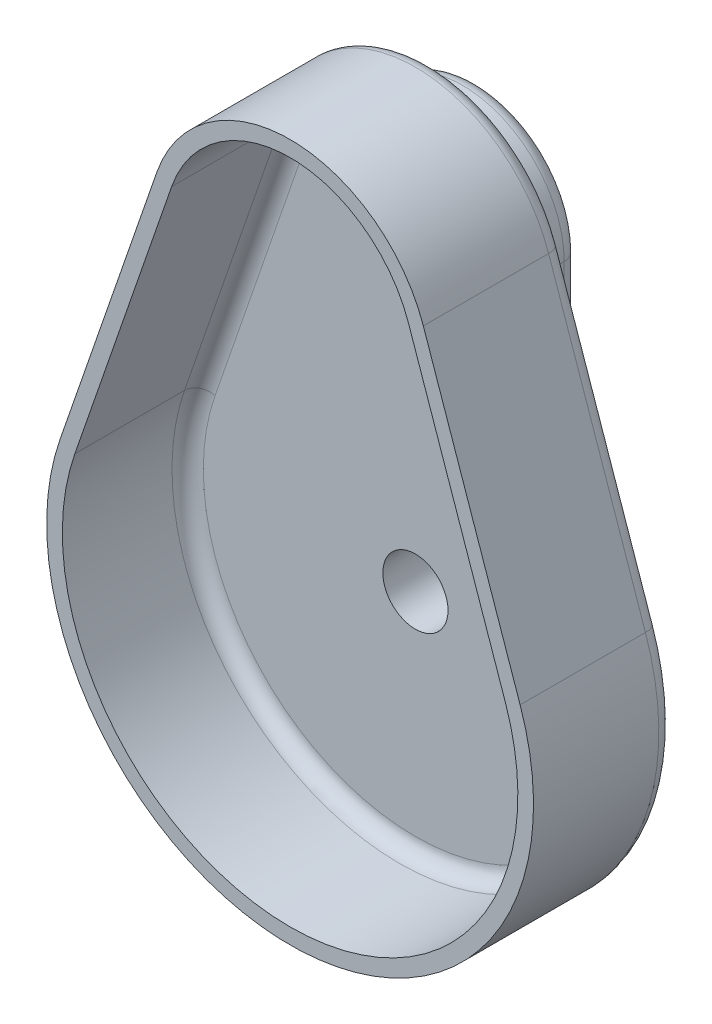
ISO-10303-21;
HEADER;
FILE_DESCRIPTION(('STEP AP214'),'2;1');
FILE_NAME('part.step','',(''),(''),'','','');
FILE_SCHEMA(('AUTOMOTIVE_DESIGN { 1 0 10303 214 1 1 1 1 }'));
ENDSEC;
DATA;
#1=APPLICATION_CONTEXT('core data for automotive mechanical design processes');
#2=APPLICATION_PROTOCOL_DEFINITION('international standard','automotive_design',2000,#1);
#3=PRODUCT_CONTEXT('',#1,'mechanical');
#4=PRODUCT('Part','Part','',(#3));
#5=PRODUCT_RELATED_PRODUCT_CATEGORY('part','',(#4));
#6=PRODUCT_DEFINITION_FORMATION('','',#4);
#7=PRODUCT_DEFINITION_CONTEXT('part definition',#1,'design');
#8=PRODUCT_DEFINITION('design','',#6,#7);
#9=PRODUCT_DEFINITION_SHAPE('','',#8);
#10=(LENGTH_UNIT() NAMED_UNIT(*) SI_UNIT(.MILLI.,.METRE.));
#11=(NAMED_UNIT(*) PLANE_ANGLE_UNIT() SI_UNIT($,.RADIAN.));
#12=(NAMED_UNIT(*) SI_UNIT($,.STERADIAN.) SOLID_ANGLE_UNIT());
#13=UNCERTAINTY_MEASURE_WITH_UNIT(LENGTH_MEASURE(1.E-05),#10,'distance_accuracy_value','');
#14=(GEOMETRIC_REPRESENTATION_CONTEXT(3) GLOBAL_UNCERTAINTY_ASSIGNED_CONTEXT((#13)) GLOBAL_UNIT_ASSIGNED_CONTEXT((#10,
#11,#12)) REPRESENTATION_CONTEXT('',''));
#15=CARTESIAN_POINT('',(0.,0.,0.));
#16=DIRECTION('',(0.,0.,1.));
#17=DIRECTION('',(1.,0.,0.));
#18=AXIS2_PLACEMENT_3D('',#15,#16,#17);
#19=CARTESIAN_POINT('',(0.,31.75,6.35));
#20=DIRECTION('',(0.,0.,-1.));
#21=DIRECTION('',(-1.,0.,0.));
#22=AXIS2_PLACEMENT_3D('',#19,#20,#21);
#23=CYLINDRICAL_SURFACE('',#22,10.31875);
#24=DIRECTION('',(0.,0.,-1.));
#25=VECTOR('',#24,1.);
#26=CARTESIAN_POINT('',(10.31875,31.75,6.35));
#27=LINE('',#26,#25);
#28=CARTESIAN_POINT('',(10.31875,31.75,3.175));
#29=VERTEX_POINT('',#28);
#30=CARTESIAN_POINT('',(10.31875,31.75,1.5875));
#31=VERTEX_POINT('',#30);
#32=EDGE_CURVE('E239',#29,#31,#27,.T.);
#33=ORIENTED_EDGE('',*,*,#32,.T.);
#34=CARTESIAN_POINT('',(0.,31.75,1.5875));
#35=DIRECTION('',(0.,0.,1.));
#36=DIRECTION('',(1.,0.,0.));
#37=AXIS2_PLACEMENT_3D('',#34,#35,#36);
#38=CIRCLE('',#37,10.31875);
#39=CARTESIAN_POINT('',(-10.31875,31.75,1.5875));
#40=VERTEX_POINT('',#39);
#41=EDGE_CURVE('E344',#31,#40,#38,.T.);
#42=ORIENTED_EDGE('',*,*,#41,.T.);
#43=DIRECTION('',(0.,0.,-1.));
#44=VECTOR('',#43,1.);
#45=CARTESIAN_POINT('',(-10.31875,31.75,6.35));
#46=LINE('',#45,#44);
#47=CARTESIAN_POINT('',(-10.31875,31.75,3.175));
#48=VERTEX_POINT('',#47);
#49=EDGE_CURVE('E247',#48,#40,#46,.T.);
#50=ORIENTED_EDGE('',*,*,#49,.F.);
#51=CARTESIAN_POINT('',(0.,31.75,3.175));
#52=DIRECTION('',(0.,0.,1.));
#53=DIRECTION('',(1.,0.,0.));
#54=AXIS2_PLACEMENT_3D('',#51,#52,#53);
#55=CIRCLE('',#54,10.31875);
#56=EDGE_CURVE('E295',#48,#29,#55,.F.);
#57=ORIENTED_EDGE('',*,*,#56,.T.);
#58=EDGE_LOOP('',(#33,#42,#50,#57));
#59=FACE_BOUND('',#58,.T.);
#60=ADVANCED_FACE('F34',(#59),#23,.T.);
#61=CARTESIAN_POINT('',(-10.31875,31.75,6.35));
#62=DIRECTION('',(1.,0.,0.));
#63=DIRECTION('',(0.,1.,0.));
#64=AXIS2_PLACEMENT_3D('',#61,#62,#63);
#65=PLANE('',#64);
#66=ORIENTED_EDGE('',*,*,#49,.T.);
#67=DIRECTION('',(0.,-1.,0.));
#68=VECTOR('',#67,1.);
#69=CARTESIAN_POINT('',(-10.31875,31.75,1.5875));
#70=LINE('',#69,#68);
#71=CARTESIAN_POINT('',(-10.31875,0.,1.5875));
#72=VERTEX_POINT('',#71);
#73=EDGE_CURVE('E303',#40,#72,#70,.T.);
#74=ORIENTED_EDGE('',*,*,#73,.T.);
#75=DIRECTION('',(0.,0.,-1.));
#76=VECTOR('',#75,1.);
#77=CARTESIAN_POINT('',(-10.31875,0.,6.35));
#78=LINE('',#77,#76);
#79=CARTESIAN_POINT('',(-10.31875,0.,3.175));
#80=VERTEX_POINT('',#79);
#81=EDGE_CURVE('E245',#80,#72,#78,.T.);
#82=ORIENTED_EDGE('',*,*,#81,.F.);
#83=DIRECTION('',(0.,-1.,0.));
#84=VECTOR('',#83,1.);
#85=CARTESIAN_POINT('',(-10.31875,31.75,3.175));
#86=LINE('',#85,#84);
#87=EDGE_CURVE('E293',#80,#48,#86,.F.);
#88=ORIENTED_EDGE('',*,*,#87,.T.);
#89=EDGE_LOOP('',(#66,#74,#82,#88));
#90=FACE_BOUND('',#89,.T.);
#91=ADVANCED_FACE('F375',(#90),#65,.F.);
#92=CARTESIAN_POINT('',(0.,0.,6.35));
#93=DIRECTION('',(0.,0.,-1.));
#94=DIRECTION('',(-1.,0.,0.));
#95=AXIS2_PLACEMENT_3D('',#92,#93,#94);
#96=CYLINDRICAL_SURFACE('',#95,10.31875);
#97=ORIENTED_EDGE('',*,*,#81,.T.);
#98=CARTESIAN_POINT('',(0.,0.,1.5875));
#99=DIRECTION('',(0.,0.,1.));
#100=DIRECTION('',(1.,0.,0.));
#101=AXIS2_PLACEMENT_3D('',#98,#99,#100);
#102=CIRCLE('',#101,10.31875);
#103=CARTESIAN_POINT('',(10.31875,0.,1.5875));
#104=VERTEX_POINT('',#103);
#105=EDGE_CURVE('E11',#72,#104,#102,.T.);
#106=ORIENTED_EDGE('',*,*,#105,.T.);
#107=DIRECTION('',(0.,0.,-1.));
#108=VECTOR('',#107,1.);
#109=CARTESIAN_POINT('',(10.31875,0.,6.35));
#110=LINE('',#109,#108);
#111=CARTESIAN_POINT('',(10.31875,0.,3.175));
#112=VERTEX_POINT('',#111);
#113=EDGE_CURVE('E243',#112,#104,#110,.T.);
#114=ORIENTED_EDGE('',*,*,#113,.F.);
#115=CARTESIAN_POINT('',(0.,0.,3.175));
#116=DIRECTION('',(0.,0.,1.));
#117=DIRECTION('',(1.,0.,0.));
#118=AXIS2_PLACEMENT_3D('',#115,#116,#117);
#119=CIRCLE('',#118,10.31875);
#120=EDGE_CURVE('E290',#112,#80,#119,.F.);
#121=ORIENTED_EDGE('',*,*,#120,.T.);
#122=EDGE_LOOP('',(#97,#106,#114,#121));
#123=FACE_BOUND('',#122,.T.);
#124=ADVANCED_FACE('F377',(#123),#96,.T.);
#125=CARTESIAN_POINT('',(10.31875,31.75,6.35));
#126=DIRECTION('',(-1.,0.,0.));
#127=DIRECTION('',(0.,-1.,0.));
#128=AXIS2_PLACEMENT_3D('',#125,#126,#127);
#129=PLANE('',#128);
#130=ORIENTED_EDGE('',*,*,#113,.T.);
#131=DIRECTION('',(0.,1.,0.));
#132=VECTOR('',#131,1.);
#133=CARTESIAN_POINT('',(10.31875,31.75,1.5875));
#134=LINE('',#133,#132);
#135=EDGE_CURVE('E43',#104,#31,#134,.T.);
#136=ORIENTED_EDGE('',*,*,#135,.T.);
#137=ORIENTED_EDGE('',*,*,#32,.F.);
#138=DIRECTION('',(0.,1.,0.));
#139=VECTOR('',#138,1.);
#140=CARTESIAN_POINT('',(10.31875,0.,3.175));
#141=LINE('',#140,#139);
#142=EDGE_CURVE('E301',#29,#112,#141,.F.);
#143=ORIENTED_EDGE('',*,*,#142,.T.);
#144=EDGE_LOOP('',(#130,#136,#137,#143));
#145=FACE_BOUND('',#144,.T.);
#146=ADVANCED_FACE('F649',(#145),#129,.F.);
#147=CARTESIAN_POINT('',(0.,31.75,6.35));
#148=DIRECTION('',(0.,0.,1.));
#149=DIRECTION('',(1.,0.,0.));
#150=AXIS2_PLACEMENT_3D('',#147,#148,#149);
#151=PLANE('',#150);
#152=CARTESIAN_POINT('',(9.08290304807061E-12,31.7500000000605,6.35));
#153=DIRECTION('',(0.,0.,1.));
#154=DIRECTION('',(1.,0.,0.));
#155=AXIS2_PLACEMENT_3D('',#152,#153,#154);
#156=CIRCLE('',#155,11.1125000000002);
#157=CARTESIAN_POINT('',(10.5015829594927,35.3837875000508,6.35));
#158=VERTEX_POINT('',#157);
#159=CARTESIAN_POINT('',(-10.5015829594726,35.3837875000566,6.35));
#160=VERTEX_POINT('',#159);
#161=EDGE_CURVE('E254',#158,#160,#156,.T.);
#162=ORIENTED_EDGE('',*,*,#161,.T.);
#163=DIRECTION('',(-0.326999999999642,-0.945024338311048,0.));
#164=VECTOR('',#163,1.);
#165=CARTESIAN_POINT('',(-20.3130618959114,7.02878324999242,6.35));
#166=LINE('',#165,#164);
#167=CARTESIAN_POINT('',(-20.3130618959114,7.02878324999241,6.35));
#168=VERTEX_POINT('',#167);
#169=EDGE_CURVE('E256',#160,#168,#166,.T.);
#170=ORIENTED_EDGE('',*,*,#169,.T.);
#171=CARTESIAN_POINT('',(0.,0.,6.35));
#172=DIRECTION('',(0.,0.,1.));
#173=DIRECTION('',(1.,0.,0.));
#174=AXIS2_PLACEMENT_3D('',#171,#172,#173);
#175=CIRCLE('',#174,21.49475);
#176=CARTESIAN_POINT('',(20.3130618959155,7.02878324998056,6.35));
#177=VERTEX_POINT('',#176);
#178=EDGE_CURVE('E250',#168,#177,#175,.T.);
#179=ORIENTED_EDGE('',*,*,#178,.T.);
#180=DIRECTION('',(-0.326999999999102,0.945024338311235,0.));
#181=VECTOR('',#180,1.);
#182=CARTESIAN_POINT('',(10.5015829594927,35.3837875000509,6.35));
#183=LINE('',#182,#181);
#184=EDGE_CURVE('E252',#177,#158,#183,.T.);
#185=ORIENTED_EDGE('',*,*,#184,.T.);
#186=EDGE_LOOP('',(#162,#170,#179,#185));
#187=FACE_BOUND('',#186,.T.);
#188=CARTESIAN_POINT('',(0.,0.,6.35));
#189=DIRECTION('',(0.,0.,1.));
#190=DIRECTION('',(1.,0.,0.));
#191=AXIS2_PLACEMENT_3D('',#188,#189,#190);
#192=CIRCLE('',#191,3.302);
#193=CARTESIAN_POINT('',(3.302,0.,6.35));
#194=VERTEX_POINT('',#193);
#195=EDGE_CURVE('E236',#194,#194,#192,.T.);
#196=ORIENTED_EDGE('',*,*,#195,.F.);
#197=EDGE_LOOP('',(#196));
#198=FACE_BOUND('',#197,.T.);
#199=CARTESIAN_POINT('',(0.,31.75,6.35));
#200=DIRECTION('',(0.,0.,1.));
#201=DIRECTION('',(1.,0.,0.));
#202=AXIS2_PLACEMENT_3D('',#199,#200,#201);
#203=CIRCLE('',#202,3.302);
#204=CARTESIAN_POINT('',(3.302,31.75,6.35));
#205=VERTEX_POINT('',#204);
#206=EDGE_CURVE('E230',#205,#205,#203,.T.);
#207=ORIENTED_EDGE('',*,*,#206,.F.);
#208=EDGE_LOOP('',(#207));
#209=FACE_BOUND('',#208,.T.);
#210=ADVANCED_FACE('F646',(#187,#198,#209),#151,.T.);
#211=CARTESIAN_POINT('',(0.,31.75,0.));
#212=DIRECTION('',(0.,0.,1.));
#213=DIRECTION('',(1.,0.,0.));
#214=AXIS2_PLACEMENT_3D('',#211,#212,#213);
#215=PLANE('',#214);
#216=CARTESIAN_POINT('',(0.,0.,0.));
#217=DIRECTION('',(0.,0.,1.));
#218=DIRECTION('',(1.,0.,0.));
#219=AXIS2_PLACEMENT_3D('',#216,#217,#218);
#220=CIRCLE('',#219,8.73125);
#221=CARTESIAN_POINT('',(8.73125,0.,0.));
#222=VERTEX_POINT('',#221);
#223=CARTESIAN_POINT('',(-8.73125,0.,0.));
#224=VERTEX_POINT('',#223);
#225=EDGE_CURVE('E335',#222,#224,#220,.F.);
#226=ORIENTED_EDGE('',*,*,#225,.T.);
#227=DIRECTION('',(0.,-1.,0.));
#228=VECTOR('',#227,1.);
#229=CARTESIAN_POINT('',(-8.73125,31.75,0.));
#230=LINE('',#229,#228);
#231=CARTESIAN_POINT('',(-8.73125,31.75,0.));
#232=VERTEX_POINT('',#231);
#233=EDGE_CURVE('E341',#224,#232,#230,.F.);
#234=ORIENTED_EDGE('',*,*,#233,.T.);
#235=CARTESIAN_POINT('',(0.,31.75,0.));
#236=DIRECTION('',(0.,0.,1.));
#237=DIRECTION('',(1.,0.,0.));
#238=AXIS2_PLACEMENT_3D('',#235,#236,#237);
#239=CIRCLE('',#238,8.73125);
#240=CARTESIAN_POINT('',(8.73125,31.75,0.));
#241=VERTEX_POINT('',#240);
#242=EDGE_CURVE('E339',#232,#241,#239,.F.);
#243=ORIENTED_EDGE('',*,*,#242,.T.);
#244=DIRECTION('',(0.,1.,0.));
#245=VECTOR('',#244,1.);
#246=CARTESIAN_POINT('',(8.73125,31.75,0.));
#247=LINE('',#246,#245);
#248=EDGE_CURVE('E337',#241,#222,#247,.F.);
#249=ORIENTED_EDGE('',*,*,#248,.T.);
#250=EDGE_LOOP('',(#226,#234,#243,#249));
#251=FACE_BOUND('',#250,.T.);
#252=CARTESIAN_POINT('',(0.,0.,0.));
#253=DIRECTION('',(0.,0.,1.));
#254=DIRECTION('',(1.,0.,0.));
#255=AXIS2_PLACEMENT_3D('',#252,#253,#254);
#256=CIRCLE('',#255,3.302);
#257=CARTESIAN_POINT('',(3.302,0.,0.));
#258=VERTEX_POINT('',#257);
#259=EDGE_CURVE('E233',#258,#258,#256,.T.);
#260=ORIENTED_EDGE('',*,*,#259,.T.);
#261=EDGE_LOOP('',(#260));
#262=FACE_BOUND('',#261,.T.);
#263=CARTESIAN_POINT('',(0.,31.75,0.));
#264=DIRECTION('',(0.,0.,1.));
#265=DIRECTION('',(1.,0.,0.));
#266=AXIS2_PLACEMENT_3D('',#263,#264,#265);
#267=CIRCLE('',#266,3.302);
#268=CARTESIAN_POINT('',(3.302,31.75,0.));
#269=VERTEX_POINT('',#268);
#270=EDGE_CURVE('E224',#269,#269,#267,.T.);
#271=ORIENTED_EDGE('',*,*,#270,.T.);
#272=EDGE_LOOP('',(#271));
#273=FACE_BOUND('',#272,.T.);
#274=ADVANCED_FACE('F365',(#251,#262,#273),#215,.F.);
#275=CARTESIAN_POINT('',(0.,0.,6.35));
#276=DIRECTION('',(0.,0.,-1.));
#277=DIRECTION('',(-1.,0.,0.));
#278=AXIS2_PLACEMENT_3D('',#275,#276,#277);
#279=CYLINDRICAL_SURFACE('',#278,3.302);
#280=ORIENTED_EDGE('',*,*,#195,.T.);
#281=EDGE_LOOP('',(#280));
#282=FACE_BOUND('',#281,.T.);
#283=ORIENTED_EDGE('',*,*,#259,.F.);
#284=EDGE_LOOP('',(#283));
#285=FACE_BOUND('',#284,.T.);
#286=ADVANCED_FACE('F664',(#282,#285),#279,.F.);
#287=CARTESIAN_POINT('',(0.,31.75,6.35));
#288=DIRECTION('',(0.,0.,-1.));
#289=DIRECTION('',(-1.,0.,0.));
#290=AXIS2_PLACEMENT_3D('',#287,#288,#289);
#291=CYLINDRICAL_SURFACE('',#290,3.302);
#292=ORIENTED_EDGE('',*,*,#206,.T.);
#293=EDGE_LOOP('',(#292));
#294=FACE_BOUND('',#293,.T.);
#295=ORIENTED_EDGE('',*,*,#270,.F.);
#296=EDGE_LOOP('',(#295));
#297=FACE_BOUND('',#296,.T.);
#298=ADVANCED_FACE('F638',(#294,#297),#291,.F.);
#299=CARTESIAN_POINT('',(9.08290304807061E-12,31.7500000000605,4.7625));
#300=DIRECTION('',(0.,0.,1.));
#301=DIRECTION('',(1.,0.,0.));
#302=AXIS2_PLACEMENT_3D('',#299,#300,#301);
#303=PLANE('',#302);
#304=CARTESIAN_POINT('',(0.,0.,4.7625));
#305=DIRECTION('',(0.,0.,1.));
#306=DIRECTION('',(1.,0.,0.));
#307=AXIS2_PLACEMENT_3D('',#304,#305,#306);
#308=CIRCLE('',#307,23.08225);
#309=CARTESIAN_POINT('',(21.8132880329845,7.54789574997914,4.7625));
#310=VERTEX_POINT('',#309);
#311=CARTESIAN_POINT('',(-21.8132880329802,7.54789574999185,4.7625));
#312=VERTEX_POINT('',#311);
#313=EDGE_CURVE('E277',#310,#312,#308,.F.);
#314=ORIENTED_EDGE('',*,*,#313,.T.);
#315=DIRECTION('',(-0.326999999999647,-0.945024338311046,0.));
#316=VECTOR('',#315,1.);
#317=CARTESIAN_POINT('',(-12.0018090965412,35.902900000056,4.7625));
#318=LINE('',#317,#316);
#319=CARTESIAN_POINT('',(-12.0018090965414,35.9029000000561,4.7625));
#320=VERTEX_POINT('',#319);
#321=EDGE_CURVE('E283',#312,#320,#318,.F.);
#322=ORIENTED_EDGE('',*,*,#321,.T.);
#323=CARTESIAN_POINT('',(9.08290304807061E-12,31.7500000000605,4.7625));
#324=DIRECTION('',(0.,0.,1.));
#325=DIRECTION('',(1.,0.,0.));
#326=AXIS2_PLACEMENT_3D('',#323,#324,#325);
#327=CIRCLE('',#326,12.7000000000002);
#328=CARTESIAN_POINT('',(12.001809096562,35.9029000000495,4.7625));
#329=VERTEX_POINT('',#328);
#330=EDGE_CURVE('E281',#320,#329,#327,.F.);
#331=ORIENTED_EDGE('',*,*,#330,.T.);
#332=DIRECTION('',(-0.326999999999097,0.945024338311237,0.));
#333=VECTOR('',#332,1.);
#334=CARTESIAN_POINT('',(21.8132880329845,7.54789574997914,4.7625));
#335=LINE('',#334,#333);
#336=EDGE_CURVE('E279',#329,#310,#335,.F.);
#337=ORIENTED_EDGE('',*,*,#336,.T.);
#338=EDGE_LOOP('',(#314,#322,#331,#337));
#339=FACE_BOUND('',#338,.T.);
#340=DIRECTION('',(0.,-1.,0.));
#341=VECTOR('',#340,1.);
#342=CARTESIAN_POINT('',(-11.90625,0.,4.7625));
#343=LINE('',#342,#341);
#344=CARTESIAN_POINT('',(-11.90625,31.75,4.7625));
#345=VERTEX_POINT('',#344);
#346=CARTESIAN_POINT('',(-11.90625,0.,4.7625));
#347=VERTEX_POINT('',#346);
#348=EDGE_CURVE('E272',#345,#347,#343,.T.);
#349=ORIENTED_EDGE('',*,*,#348,.T.);
#350=CARTESIAN_POINT('',(0.,0.,4.7625));
#351=DIRECTION('',(0.,0.,1.));
#352=DIRECTION('',(1.,0.,0.));
#353=AXIS2_PLACEMENT_3D('',#350,#351,#352);
#354=CIRCLE('',#353,11.90625);
#355=CARTESIAN_POINT('',(11.90625,0.,4.7625));
#356=VERTEX_POINT('',#355);
#357=EDGE_CURVE('E274',#347,#356,#354,.T.);
#358=ORIENTED_EDGE('',*,*,#357,.T.);
#359=DIRECTION('',(0.,1.,0.));
#360=VECTOR('',#359,1.);
#361=CARTESIAN_POINT('',(11.90625,31.75,4.7625));
#362=LINE('',#361,#360);
#363=CARTESIAN_POINT('',(11.90625,31.75,4.7625));
#364=VERTEX_POINT('',#363);
#365=EDGE_CURVE('E268',#356,#364,#362,.T.);
#366=ORIENTED_EDGE('',*,*,#365,.T.);
#367=CARTESIAN_POINT('',(0.,31.75,4.7625));
#368=DIRECTION('',(0.,0.,1.));
#369=DIRECTION('',(1.,0.,0.));
#370=AXIS2_PLACEMENT_3D('',#367,#368,#369);
#371=CIRCLE('',#370,11.90625);
#372=EDGE_CURVE('E270',#364,#345,#371,.T.);
#373=ORIENTED_EDGE('',*,*,#372,.T.);
#374=EDGE_LOOP('',(#349,#358,#366,#373));
#375=FACE_BOUND('',#374,.T.);
#376=ADVANCED_FACE('F392',(#339,#375),#303,.F.);
#377=CARTESIAN_POINT('',(9.08290304807061E-12,31.7500000000605,4.7625));
#378=DIRECTION('',(0.,0.,1.));
#379=DIRECTION('',(1.,0.,0.));
#380=AXIS2_PLACEMENT_3D('',#377,#378,#379);
#381=CYLINDRICAL_SURFACE('',#380,14.2875000000002);
#382=DIRECTION('',(0.,0.,1.));
#383=VECTOR('',#382,1.);
#384=CARTESIAN_POINT('',(13.502035233631,36.4220125000481,4.7625));
#385=LINE('',#384,#383);
#386=CARTESIAN_POINT('',(13.502035233631,36.4220125000481,6.35));
#387=VERTEX_POINT('',#386);
#388=CARTESIAN_POINT('',(13.5020352336309,36.422012500048,19.05));
#389=VERTEX_POINT('',#388);
#390=EDGE_CURVE('E222',#387,#389,#385,.T.);
#391=ORIENTED_EDGE('',*,*,#390,.F.);
#392=CARTESIAN_POINT('',(9.08290304807061E-12,31.7500000000605,6.35));
#393=DIRECTION('',(0.,0.,1.));
#394=DIRECTION('',(1.,0.,0.));
#395=AXIS2_PLACEMENT_3D('',#392,#393,#394);
#396=CIRCLE('',#395,14.2875000000002);
#397=CARTESIAN_POINT('',(-13.50203523361,36.4220125000555,6.35));
#398=VERTEX_POINT('',#397);
#399=EDGE_CURVE('E286',#387,#398,#396,.T.);
#400=ORIENTED_EDGE('',*,*,#399,.T.);
#401=DIRECTION('',(0.,0.,1.));
#402=VECTOR('',#401,1.);
#403=CARTESIAN_POINT('',(-13.50203523361,36.4220125000555,4.7625));
#404=LINE('',#403,#402);
#405=CARTESIAN_POINT('',(-13.5020352336101,36.4220125000555,19.05));
#406=VERTEX_POINT('',#405);
#407=EDGE_CURVE('E221',#398,#406,#404,.T.);
#408=ORIENTED_EDGE('',*,*,#407,.T.);
#409=CARTESIAN_POINT('',(9.08290304807061E-12,31.7500000000605,19.05));
#410=DIRECTION('',(0.,0.,1.));
#411=DIRECTION('',(1.,0.,0.));
#412=AXIS2_PLACEMENT_3D('',#409,#410,#411);
#413=CIRCLE('',#412,14.2875000000002);
#414=EDGE_CURVE('E193',#389,#406,#413,.T.);
#415=ORIENTED_EDGE('',*,*,#414,.F.);
#416=EDGE_LOOP('',(#391,#400,#408,#415));
#417=FACE_BOUND('',#416,.T.);
#418=ADVANCED_FACE('F617',(#417),#381,.T.);
#419=CARTESIAN_POINT('',(13.5020352336489,36.4220124999965,4.7625));
#420=DIRECTION('',(0.945024338311237,0.326999999999097,0.));
#421=DIRECTION('',(-0.326999999999097,0.945024338311237,0.));
#422=AXIS2_PLACEMENT_3D('',#419,#420,#421);
#423=PLANE('',#422);
#424=DIRECTION('',(0.,0.,1.));
#425=VECTOR('',#424,1.);
#426=CARTESIAN_POINT('',(23.3135141700536,8.0670082499777,4.7625));
#427=LINE('',#426,#425);
#428=CARTESIAN_POINT('',(23.3135141700536,8.0670082499777,6.35));
#429=VERTEX_POINT('',#428);
#430=CARTESIAN_POINT('',(23.3135141700536,8.06700824997771,19.05));
#431=VERTEX_POINT('',#430);
#432=EDGE_CURVE('E225',#429,#431,#427,.T.);
#433=ORIENTED_EDGE('',*,*,#432,.F.);
#434=DIRECTION('',(-0.326999999999097,0.945024338311237,0.));
#435=VECTOR('',#434,1.);
#436=CARTESIAN_POINT('',(13.502035233631,36.4220125000481,6.35));
#437=LINE('',#436,#435);
#438=EDGE_CURVE('E288',#429,#387,#437,.T.);
#439=ORIENTED_EDGE('',*,*,#438,.T.);
#440=ORIENTED_EDGE('',*,*,#390,.T.);
#441=DIRECTION('',(-0.326999999999101,0.945024338311235,0.));
#442=VECTOR('',#441,1.);
#443=CARTESIAN_POINT('',(23.3135141700536,8.06700824997771,19.05));
#444=LINE('',#443,#442);
#445=EDGE_CURVE('E218',#431,#389,#444,.T.);
#446=ORIENTED_EDGE('',*,*,#445,.F.);
#447=EDGE_LOOP('',(#433,#439,#440,#446));
#448=FACE_BOUND('',#447,.T.);
#449=ADVANCED_FACE('F606',(#448),#423,.T.);
#450=CARTESIAN_POINT('',(0.,0.,4.7625));
#451=DIRECTION('',(0.,0.,1.));
#452=DIRECTION('',(1.,0.,0.));
#453=AXIS2_PLACEMENT_3D('',#450,#451,#452);
#454=CYLINDRICAL_SURFACE('',#453,24.66975);
#455=DIRECTION('',(0.,0.,1.));
#456=VECTOR('',#455,1.);
#457=CARTESIAN_POINT('',(-23.3135141700489,8.06700824999128,4.7625));
#458=LINE('',#457,#456);
#459=CARTESIAN_POINT('',(-23.3135141700489,8.06700824999128,6.35));
#460=VERTEX_POINT('',#459);
#461=CARTESIAN_POINT('',(-23.3135141700489,8.06700824999128,19.05));
#462=VERTEX_POINT('',#461);
#463=EDGE_CURVE('E227',#460,#462,#458,.T.);
#464=ORIENTED_EDGE('',*,*,#463,.F.);
#465=CARTESIAN_POINT('',(0.,0.,6.35));
#466=DIRECTION('',(0.,0.,1.));
#467=DIRECTION('',(1.,0.,0.));
#468=AXIS2_PLACEMENT_3D('',#465,#466,#467);
#469=CIRCLE('',#468,24.66975);
#470=EDGE_CURVE('E299',#460,#429,#469,.T.);
#471=ORIENTED_EDGE('',*,*,#470,.T.);
#472=ORIENTED_EDGE('',*,*,#432,.T.);
#473=CARTESIAN_POINT('',(0.,0.,19.05));
#474=DIRECTION('',(0.,0.,1.));
#475=DIRECTION('',(1.,0.,0.));
#476=AXIS2_PLACEMENT_3D('',#473,#474,#475);
#477=CIRCLE('',#476,24.66975);
#478=EDGE_CURVE('E215',#462,#431,#477,.T.);
#479=ORIENTED_EDGE('',*,*,#478,.F.);
#480=EDGE_LOOP('',(#464,#471,#472,#479));
#481=FACE_BOUND('',#480,.T.);
#482=ADVANCED_FACE('F593',(#481),#454,.T.);
#483=CARTESIAN_POINT('',(-13.5020352336297,36.4220124999986,4.7625));
#484=DIRECTION('',(-0.945024338311046,0.326999999999647,0.));
#485=DIRECTION('',(-0.326999999999647,-0.945024338311046,0.));
#486=AXIS2_PLACEMENT_3D('',#483,#484,#485);
#487=PLANE('',#486);
#488=ORIENTED_EDGE('',*,*,#407,.F.);
#489=DIRECTION('',(-0.326999999999647,-0.945024338311046,0.));
#490=VECTOR('',#489,1.);
#491=CARTESIAN_POINT('',(-23.3135141700489,8.06700824999129,6.35));
#492=LINE('',#491,#490);
#493=EDGE_CURVE('E265',#398,#460,#492,.T.);
#494=ORIENTED_EDGE('',*,*,#493,.T.);
#495=ORIENTED_EDGE('',*,*,#463,.T.);
#496=DIRECTION('',(-0.326999999999642,-0.945024338311048,0.));
#497=VECTOR('',#496,1.);
#498=CARTESIAN_POINT('',(-13.5020352336101,36.4220125000555,19.05));
#499=LINE('',#498,#497);
#500=EDGE_CURVE('E212',#406,#462,#499,.T.);
#501=ORIENTED_EDGE('',*,*,#500,.F.);
#502=EDGE_LOOP('',(#488,#494,#495,#501));
#503=FACE_BOUND('',#502,.T.);
#504=ADVANCED_FACE('F582',(#503),#487,.T.);
#505=CARTESIAN_POINT('',(9.08290304807061E-12,31.7500000000605,19.05));
#506=DIRECTION('',(0.,0.,1.));
#507=DIRECTION('',(1.,0.,0.));
#508=AXIS2_PLACEMENT_3D('',#505,#506,#507);
#509=PLANE('',#508);
#510=ORIENTED_EDGE('',*,*,#414,.T.);
#511=ORIENTED_EDGE('',*,*,#500,.T.);
#512=ORIENTED_EDGE('',*,*,#478,.T.);
#513=ORIENTED_EDGE('',*,*,#445,.T.);
#514=EDGE_LOOP('',(#510,#511,#512,#513));
#515=FACE_BOUND('',#514,.T.);
#516=DIRECTION('',(-0.326999999999101,0.945024338311235,0.));
#517=VECTOR('',#516,1.);
#518=CARTESIAN_POINT('',(21.8132880329845,7.54789574997914,19.05));
#519=LINE('',#518,#517);
#520=CARTESIAN_POINT('',(21.8132880329845,7.54789574997914,19.05));
#521=VERTEX_POINT('',#520);
#522=CARTESIAN_POINT('',(12.0018090965618,35.9029000000494,19.05));
#523=VERTEX_POINT('',#522);
#524=EDGE_CURVE('E184',#521,#523,#519,.T.);
#525=ORIENTED_EDGE('',*,*,#524,.F.);
#526=CARTESIAN_POINT('',(0.,0.,19.05));
#527=DIRECTION('',(0.,0.,1.));
#528=DIRECTION('',(1.,0.,0.));
#529=AXIS2_PLACEMENT_3D('',#526,#527,#528);
#530=CIRCLE('',#529,23.08225);
#531=CARTESIAN_POINT('',(-21.8132880329802,7.54789574999184,19.05));
#532=VERTEX_POINT('',#531);
#533=EDGE_CURVE('E174',#532,#521,#530,.T.);
#534=ORIENTED_EDGE('',*,*,#533,.F.);
#535=DIRECTION('',(-0.326999999999642,-0.945024338311048,0.));
#536=VECTOR('',#535,1.);
#537=CARTESIAN_POINT('',(-12.0018090965414,35.9029000000561,19.05));
#538=LINE('',#537,#536);
#539=CARTESIAN_POINT('',(-12.0018090965414,35.9029000000561,19.05));
#540=VERTEX_POINT('',#539);
#541=EDGE_CURVE('E201',#540,#532,#538,.T.);
#542=ORIENTED_EDGE('',*,*,#541,.F.);
#543=CARTESIAN_POINT('',(9.08290304807061E-12,31.7500000000605,19.05));
#544=DIRECTION('',(0.,0.,1.));
#545=DIRECTION('',(1.,0.,0.));
#546=AXIS2_PLACEMENT_3D('',#543,#544,#545);
#547=CIRCLE('',#546,12.7000000000002);
#548=EDGE_CURVE('E199',#523,#540,#547,.T.);
#549=ORIENTED_EDGE('',*,*,#548,.F.);
#550=EDGE_LOOP('',(#525,#534,#542,#549));
#551=FACE_BOUND('',#550,.T.);
#552=ADVANCED_FACE('F197',(#515,#551),#509,.T.);
#553=CARTESIAN_POINT('',(0.,0.,19.05));
#554=DIRECTION('',(0.,0.,-1.));
#555=DIRECTION('',(-1.,0.,0.));
#556=AXIS2_PLACEMENT_3D('',#553,#554,#555);
#557=CYLINDRICAL_SURFACE('',#556,23.08225);
#558=DIRECTION('',(0.,0.,-1.));
#559=VECTOR('',#558,1.);
#560=CARTESIAN_POINT('',(21.8132880329845,7.54789574997914,19.05));
#561=LINE('',#560,#559);
#562=CARTESIAN_POINT('',(21.8132880329845,7.54789574997914,7.9375));
#563=VERTEX_POINT('',#562);
#564=EDGE_CURVE('E177',#521,#563,#561,.T.);
#565=ORIENTED_EDGE('',*,*,#564,.T.);
#566=CARTESIAN_POINT('',(0.,0.,7.9375));
#567=DIRECTION('',(0.,0.,1.));
#568=DIRECTION('',(1.,0.,0.));
#569=AXIS2_PLACEMENT_3D('',#566,#567,#568);
#570=CIRCLE('',#569,23.08225);
#571=CARTESIAN_POINT('',(-21.8132880329802,7.54789574999184,7.9375));
#572=VERTEX_POINT('',#571);
#573=EDGE_CURVE('E297',#563,#572,#570,.F.);
#574=ORIENTED_EDGE('',*,*,#573,.T.);
#575=DIRECTION('',(0.,0.,-1.));
#576=VECTOR('',#575,1.);
#577=CARTESIAN_POINT('',(-21.8132880329802,7.54789574999184,19.05));
#578=LINE('',#577,#576);
#579=EDGE_CURVE('E180',#532,#572,#578,.T.);
#580=ORIENTED_EDGE('',*,*,#579,.F.);
#581=ORIENTED_EDGE('',*,*,#533,.T.);
#582=EDGE_LOOP('',(#565,#574,#580,#581));
#583=FACE_BOUND('',#582,.T.);
#584=ADVANCED_FACE('F176',(#583),#557,.F.);
#585=CARTESIAN_POINT('',(21.8132880329845,7.54789574997914,19.05));
#586=DIRECTION('',(-0.945024338311235,-0.326999999999102,0.));
#587=DIRECTION('',(0.326999999999102,-0.945024338311235,0.));
#588=AXIS2_PLACEMENT_3D('',#585,#586,#587);
#589=PLANE('',#588);
#590=DIRECTION('',(0.,0.,-1.));
#591=VECTOR('',#590,1.);
#592=CARTESIAN_POINT('',(12.0018090965618,35.9029000000494,19.05));
#593=LINE('',#592,#591);
#594=CARTESIAN_POINT('',(12.0018090965618,35.9029000000494,7.9375));
#595=VERTEX_POINT('',#594);
#596=EDGE_CURVE('E194',#523,#595,#593,.T.);
#597=ORIENTED_EDGE('',*,*,#596,.T.);
#598=DIRECTION('',(-0.326999999999102,0.945024338311235,0.));
#599=VECTOR('',#598,1.);
#600=CARTESIAN_POINT('',(21.8132880329845,7.54789574997913,7.9375));
#601=LINE('',#600,#599);
#602=EDGE_CURVE('E192',#595,#563,#601,.F.);
#603=ORIENTED_EDGE('',*,*,#602,.T.);
#604=ORIENTED_EDGE('',*,*,#564,.F.);
#605=ORIENTED_EDGE('',*,*,#524,.T.);
#606=EDGE_LOOP('',(#597,#603,#604,#605));
#607=FACE_BOUND('',#606,.T.);
#608=ADVANCED_FACE('F189',(#607),#589,.T.);
#609=CARTESIAN_POINT('',(9.08290304807061E-12,31.7500000000605,19.05));
#610=DIRECTION('',(0.,0.,-1.));
#611=DIRECTION('',(-1.,0.,0.));
#612=AXIS2_PLACEMENT_3D('',#609,#610,#611);
#613=CYLINDRICAL_SURFACE('',#612,12.7000000000002);
#614=DIRECTION('',(0.,0.,-1.));
#615=VECTOR('',#614,1.);
#616=CARTESIAN_POINT('',(-12.0018090965414,35.9029000000561,19.05));
#617=LINE('',#616,#615);
#618=CARTESIAN_POINT('',(-12.0018090965414,35.9029000000561,7.9375));
#619=VERTEX_POINT('',#618);
#620=EDGE_CURVE('E206',#540,#619,#617,.T.);
#621=ORIENTED_EDGE('',*,*,#620,.T.);
#622=CARTESIAN_POINT('',(9.08290304807061E-12,31.7500000000605,7.9375));
#623=DIRECTION('',(0.,0.,1.));
#624=DIRECTION('',(1.,0.,0.));
#625=AXIS2_PLACEMENT_3D('',#622,#623,#624);
#626=CIRCLE('',#625,12.7000000000002);
#627=EDGE_CURVE('E262',#619,#595,#626,.F.);
#628=ORIENTED_EDGE('',*,*,#627,.T.);
#629=ORIENTED_EDGE('',*,*,#596,.F.);
#630=ORIENTED_EDGE('',*,*,#548,.T.);
#631=EDGE_LOOP('',(#621,#628,#629,#630));
#632=FACE_BOUND('',#631,.T.);
#633=ADVANCED_FACE('F550',(#632),#613,.F.);
#634=CARTESIAN_POINT('',(-12.0018090965414,35.9029000000561,19.05));
#635=DIRECTION('',(0.945024338311048,-0.326999999999642,0.));
#636=DIRECTION('',(0.326999999999642,0.945024338311048,0.));
#637=AXIS2_PLACEMENT_3D('',#634,#635,#636);
#638=PLANE('',#637);
#639=ORIENTED_EDGE('',*,*,#579,.T.);
#640=DIRECTION('',(-0.326999999999642,-0.945024338311048,0.));
#641=VECTOR('',#640,1.);
#642=CARTESIAN_POINT('',(-12.0018090965414,35.9029000000561,7.9375));
#643=LINE('',#642,#641);
#644=EDGE_CURVE('E259',#572,#619,#643,.F.);
#645=ORIENTED_EDGE('',*,*,#644,.T.);
#646=ORIENTED_EDGE('',*,*,#620,.F.);
#647=ORIENTED_EDGE('',*,*,#541,.T.);
#648=EDGE_LOOP('',(#639,#645,#646,#647));
#649=FACE_BOUND('',#648,.T.);
#650=ADVANCED_FACE('F436',(#649),#638,.T.);
#651=CARTESIAN_POINT('',(10.5015829595106,35.3837874999993,7.9375));
#652=DIRECTION('',(0.326999999999102,-0.945024338311235,0.));
#653=DIRECTION('',(0.945024338311235,0.326999999999102,0.));
#654=AXIS2_PLACEMENT_3D('',#651,#652,#653);
#655=CYLINDRICAL_SURFACE('',#654,1.5875);
#656=CARTESIAN_POINT('',(20.3130618959155,7.02878324998056,7.9375));
#657=DIRECTION('',(-0.326999999999101,0.945024338311235,0.));
#658=DIRECTION('',(-0.945024338311235,-0.326999999999101,0.));
#659=AXIS2_PLACEMENT_3D('',#656,#657,#658);
#660=CIRCLE('',#659,1.5875);
#661=EDGE_CURVE('E309',#563,#177,#660,.T.);
#662=ORIENTED_EDGE('',*,*,#661,.F.);
#663=ORIENTED_EDGE('',*,*,#602,.F.);
#664=CARTESIAN_POINT('',(10.5015829594927,35.3837875000508,7.9375));
#665=DIRECTION('',(0.326999999999122,-0.945024338311228,0.));
#666=DIRECTION('',(0.945024338311228,0.326999999999122,0.));
#667=AXIS2_PLACEMENT_3D('',#664,#665,#666);
#668=CIRCLE('',#667,1.5875);
#669=EDGE_CURVE('E185',#158,#595,#668,.T.);
#670=ORIENTED_EDGE('',*,*,#669,.F.);
#671=ORIENTED_EDGE('',*,*,#184,.F.);
#672=EDGE_LOOP('',(#662,#663,#670,#671));
#673=FACE_BOUND('',#672,.T.);
#674=ADVANCED_FACE('F433',(#673),#655,.F.);
#675=CARTESIAN_POINT('',(9.08290304807061E-12,31.7500000000605,7.9375));
#676=DIRECTION('',(0.,0.,1.));
#677=DIRECTION('',(1.,0.,0.));
#678=AXIS2_PLACEMENT_3D('',#675,#676,#677);
#679=TOROIDAL_SURFACE('',#678,11.1125000000002,1.5875);
#680=ORIENTED_EDGE('',*,*,#669,.T.);
#681=ORIENTED_EDGE('',*,*,#627,.F.);
#682=CARTESIAN_POINT('',(-10.5015829594726,35.3837875000566,7.9375));
#683=DIRECTION('',(0.326999999999643,0.945024338311048,0.));
#684=DIRECTION('',(-0.945024338311048,0.326999999999643,0.));
#685=AXIS2_PLACEMENT_3D('',#682,#683,#684);
#686=CIRCLE('',#685,1.5875);
#687=EDGE_CURVE('E306',#160,#619,#686,.T.);
#688=ORIENTED_EDGE('',*,*,#687,.F.);
#689=ORIENTED_EDGE('',*,*,#161,.F.);
#690=EDGE_LOOP('',(#680,#681,#688,#689));
#691=FACE_BOUND('',#690,.T.);
#692=ADVANCED_FACE('F429',(#691),#679,.F.);
#693=CARTESIAN_POINT('',(0.,0.,7.9375));
#694=DIRECTION('',(0.,0.,1.));
#695=DIRECTION('',(1.,0.,0.));
#696=AXIS2_PLACEMENT_3D('',#693,#694,#695);
#697=TOROIDAL_SURFACE('',#696,21.49475,1.5875);
#698=ORIENTED_EDGE('',*,*,#661,.T.);
#699=ORIENTED_EDGE('',*,*,#178,.F.);
#700=CARTESIAN_POINT('',(-20.3130618959114,7.02878324999241,7.9375));
#701=DIRECTION('',(-0.326999999999646,-0.945024338311046,0.));
#702=DIRECTION('',(0.945024338311046,-0.326999999999646,0.));
#703=AXIS2_PLACEMENT_3D('',#700,#701,#702);
#704=CIRCLE('',#703,1.5875);
#705=EDGE_CURVE('E304',#572,#168,#704,.T.);
#706=ORIENTED_EDGE('',*,*,#705,.F.);
#707=ORIENTED_EDGE('',*,*,#573,.F.);
#708=EDGE_LOOP('',(#698,#699,#706,#707));
#709=FACE_BOUND('',#708,.T.);
#710=ADVANCED_FACE('F425',(#709),#697,.F.);
#711=CARTESIAN_POINT('',(-10.5015829594923,35.3837874999997,7.9375));
#712=DIRECTION('',(0.326999999999642,0.945024338311048,0.));
#713=DIRECTION('',(-0.945024338311048,0.326999999999642,0.));
#714=AXIS2_PLACEMENT_3D('',#711,#712,#713);
#715=CYLINDRICAL_SURFACE('',#714,1.5875);
#716=ORIENTED_EDGE('',*,*,#687,.T.);
#717=ORIENTED_EDGE('',*,*,#644,.F.);
#718=ORIENTED_EDGE('',*,*,#705,.T.);
#719=ORIENTED_EDGE('',*,*,#169,.F.);
#720=EDGE_LOOP('',(#716,#717,#718,#719));
#721=FACE_BOUND('',#720,.T.);
#722=ADVANCED_FACE('F421',(#721),#715,.F.);
#723=CARTESIAN_POINT('',(12.0018090965798,35.9028999999979,6.35));
#724=DIRECTION('',(0.326999999999097,-0.945024338311237,0.));
#725=DIRECTION('',(0.945024338311237,0.326999999999097,0.));
#726=AXIS2_PLACEMENT_3D('',#723,#724,#725);
#727=CYLINDRICAL_SURFACE('',#726,1.5875);
#728=CARTESIAN_POINT('',(21.8132880329845,7.54789574997914,6.35));
#729=DIRECTION('',(0.326999999999096,-0.945024338311237,0.));
#730=DIRECTION('',(0.945024338311237,0.326999999999096,0.));
#731=AXIS2_PLACEMENT_3D('',#728,#729,#730);
#732=CIRCLE('',#731,1.5875);
#733=EDGE_CURVE('E319',#310,#429,#732,.T.);
#734=ORIENTED_EDGE('',*,*,#733,.F.);
#735=ORIENTED_EDGE('',*,*,#336,.F.);
#736=CARTESIAN_POINT('',(12.001809096562,35.9029000000495,6.35));
#737=DIRECTION('',(-0.326999999999096,0.945024338311237,0.));
#738=DIRECTION('',(-0.945024338311237,-0.326999999999096,0.));
#739=AXIS2_PLACEMENT_3D('',#736,#737,#738);
#740=CIRCLE('',#739,1.5875);
#741=EDGE_CURVE('E307',#387,#329,#740,.T.);
#742=ORIENTED_EDGE('',*,*,#741,.F.);
#743=ORIENTED_EDGE('',*,*,#438,.F.);
#744=EDGE_LOOP('',(#734,#735,#742,#743));
#745=FACE_BOUND('',#744,.T.);
#746=ADVANCED_FACE('F424',(#745),#727,.T.);
#747=CARTESIAN_POINT('',(9.08290304807061E-12,31.7500000000605,6.35));
#748=DIRECTION('',(0.,0.,1.));
#749=DIRECTION('',(1.,0.,0.));
#750=AXIS2_PLACEMENT_3D('',#747,#748,#749);
#751=TOROIDAL_SURFACE('',#750,12.7000000000002,1.5875);
#752=ORIENTED_EDGE('',*,*,#741,.T.);
#753=ORIENTED_EDGE('',*,*,#330,.F.);
#754=CARTESIAN_POINT('',(-12.0018090965414,35.9029000000561,6.35));
#755=DIRECTION('',(-0.326999999999647,-0.945024338311046,0.));
#756=DIRECTION('',(0.945024338311046,-0.326999999999647,0.));
#757=AXIS2_PLACEMENT_3D('',#754,#755,#756);
#758=CIRCLE('',#757,1.5875);
#759=EDGE_CURVE('E316',#398,#320,#758,.T.);
#760=ORIENTED_EDGE('',*,*,#759,.F.);
#761=ORIENTED_EDGE('',*,*,#399,.F.);
#762=EDGE_LOOP('',(#752,#753,#760,#761));
#763=FACE_BOUND('',#762,.T.);
#764=ADVANCED_FACE('F441',(#763),#751,.T.);
#765=CARTESIAN_POINT('',(0.,0.,6.35));
#766=DIRECTION('',(0.,0.,1.));
#767=DIRECTION('',(1.,0.,0.));
#768=AXIS2_PLACEMENT_3D('',#765,#766,#767);
#769=TOROIDAL_SURFACE('',#768,23.08225,1.5875);
#770=ORIENTED_EDGE('',*,*,#733,.T.);
#771=ORIENTED_EDGE('',*,*,#470,.F.);
#772=CARTESIAN_POINT('',(-21.8132880329802,7.54789574999185,6.35));
#773=DIRECTION('',(0.326999999999647,0.945024338311046,0.));
#774=DIRECTION('',(-0.945024338311047,0.326999999999647,0.));
#775=AXIS2_PLACEMENT_3D('',#772,#773,#774);
#776=CIRCLE('',#775,1.5875);
#777=EDGE_CURVE('E314',#312,#460,#776,.T.);
#778=ORIENTED_EDGE('',*,*,#777,.F.);
#779=ORIENTED_EDGE('',*,*,#313,.F.);
#780=EDGE_LOOP('',(#770,#771,#778,#779));
#781=FACE_BOUND('',#780,.T.);
#782=ADVANCED_FACE('F409',(#781),#769,.T.);
#783=CARTESIAN_POINT('',(-12.0018090965609,35.9028999999992,6.35));
#784=DIRECTION('',(0.326999999999647,0.945024338311046,0.));
#785=DIRECTION('',(-0.945024338311046,0.326999999999647,0.));
#786=AXIS2_PLACEMENT_3D('',#783,#784,#785);
#787=CYLINDRICAL_SURFACE('',#786,1.5875);
#788=ORIENTED_EDGE('',*,*,#759,.T.);
#789=ORIENTED_EDGE('',*,*,#321,.F.);
#790=ORIENTED_EDGE('',*,*,#777,.T.);
#791=ORIENTED_EDGE('',*,*,#493,.F.);
#792=EDGE_LOOP('',(#788,#789,#790,#791));
#793=FACE_BOUND('',#792,.T.);
#794=ADVANCED_FACE('F402',(#793),#787,.T.);
#795=CARTESIAN_POINT('',(0.,31.75,3.175));
#796=DIRECTION('',(0.,0.,1.));
#797=DIRECTION('',(1.,0.,0.));
#798=AXIS2_PLACEMENT_3D('',#795,#796,#797);
#799=TOROIDAL_SURFACE('',#798,11.90625,1.5875);
#800=CARTESIAN_POINT('',(11.90625,31.75,3.175));
#801=DIRECTION('',(0.,1.,0.));
#802=DIRECTION('',(0.,0.,1.));
#803=AXIS2_PLACEMENT_3D('',#800,#801,#802);
#804=CIRCLE('',#803,1.5875);
#805=EDGE_CURVE('E328',#29,#364,#804,.T.);
#806=ORIENTED_EDGE('',*,*,#805,.F.);
#807=ORIENTED_EDGE('',*,*,#56,.F.);
#808=CARTESIAN_POINT('',(-11.90625,31.75,3.175));
#809=DIRECTION('',(0.,1.,0.));
#810=DIRECTION('',(0.,0.,1.));
#811=AXIS2_PLACEMENT_3D('',#808,#809,#810);
#812=CIRCLE('',#811,1.5875);
#813=EDGE_CURVE('E317',#345,#48,#812,.T.);
#814=ORIENTED_EDGE('',*,*,#813,.F.);
#815=ORIENTED_EDGE('',*,*,#372,.F.);
#816=EDGE_LOOP('',(#806,#807,#814,#815));
#817=FACE_BOUND('',#816,.T.);
#818=ADVANCED_FACE('F400',(#817),#799,.F.);
#819=CARTESIAN_POINT('',(-11.90625,31.7500000000605,3.175));
#820=DIRECTION('',(0.,1.,0.));
#821=DIRECTION('',(-1.,0.,0.));
#822=AXIS2_PLACEMENT_3D('',#819,#820,#821);
#823=CYLINDRICAL_SURFACE('',#822,1.5875);
#824=ORIENTED_EDGE('',*,*,#813,.T.);
#825=ORIENTED_EDGE('',*,*,#87,.F.);
#826=CARTESIAN_POINT('',(-11.90625,0.,3.175));
#827=DIRECTION('',(0.,1.,0.));
#828=DIRECTION('',(-1.,0.,0.));
#829=AXIS2_PLACEMENT_3D('',#826,#827,#828);
#830=CIRCLE('',#829,1.5875);
#831=EDGE_CURVE('E326',#347,#80,#830,.T.);
#832=ORIENTED_EDGE('',*,*,#831,.F.);
#833=ORIENTED_EDGE('',*,*,#348,.F.);
#834=EDGE_LOOP('',(#824,#825,#832,#833));
#835=FACE_BOUND('',#834,.T.);
#836=ADVANCED_FACE('F396',(#835),#823,.F.);
#837=CARTESIAN_POINT('',(11.90625,31.7500000000605,3.175));
#838=DIRECTION('',(0.,-1.,0.));
#839=DIRECTION('',(1.,0.,0.));
#840=AXIS2_PLACEMENT_3D('',#837,#838,#839);
#841=CYLINDRICAL_SURFACE('',#840,1.5875);
#842=ORIENTED_EDGE('',*,*,#805,.T.);
#843=ORIENTED_EDGE('',*,*,#365,.F.);
#844=CARTESIAN_POINT('',(11.90625,0.,3.175));
#845=DIRECTION('',(0.,1.,0.));
#846=DIRECTION('',(-1.,0.,0.));
#847=AXIS2_PLACEMENT_3D('',#844,#845,#846);
#848=CIRCLE('',#847,1.5875);
#849=EDGE_CURVE('E324',#112,#356,#848,.T.);
#850=ORIENTED_EDGE('',*,*,#849,.F.);
#851=ORIENTED_EDGE('',*,*,#142,.F.);
#852=EDGE_LOOP('',(#842,#843,#850,#851));
#853=FACE_BOUND('',#852,.T.);
#854=ADVANCED_FACE('F388',(#853),#841,.F.);
#855=CARTESIAN_POINT('',(0.,0.,3.175));
#856=DIRECTION('',(0.,0.,1.));
#857=DIRECTION('',(1.,0.,0.));
#858=AXIS2_PLACEMENT_3D('',#855,#856,#857);
#859=TOROIDAL_SURFACE('',#858,11.90625,1.5875);
#860=ORIENTED_EDGE('',*,*,#831,.T.);
#861=ORIENTED_EDGE('',*,*,#120,.F.);
#862=ORIENTED_EDGE('',*,*,#849,.T.);
#863=ORIENTED_EDGE('',*,*,#357,.F.);
#864=EDGE_LOOP('',(#860,#861,#862,#863));
#865=FACE_BOUND('',#864,.T.);
#866=ADVANCED_FACE('F381',(#865),#859,.F.);
#867=CARTESIAN_POINT('',(8.73125,31.75,1.5875));
#868=DIRECTION('',(0.,1.,0.));
#869=DIRECTION('',(-1.,0.,0.));
#870=AXIS2_PLACEMENT_3D('',#867,#868,#869);
#871=CYLINDRICAL_SURFACE('',#870,1.5875);
#872=CARTESIAN_POINT('',(8.73125,0.,1.5875));
#873=DIRECTION('',(0.,-1.,0.));
#874=DIRECTION('',(1.,0.,0.));
#875=AXIS2_PLACEMENT_3D('',#872,#873,#874);
#876=CIRCLE('',#875,1.5875);
#877=EDGE_CURVE('E350',#222,#104,#876,.T.);
#878=ORIENTED_EDGE('',*,*,#877,.F.);
#879=ORIENTED_EDGE('',*,*,#248,.F.);
#880=CARTESIAN_POINT('',(8.73125,31.75,1.5875));
#881=DIRECTION('',(0.,1.,0.));
#882=DIRECTION('',(0.,0.,1.));
#883=AXIS2_PLACEMENT_3D('',#880,#881,#882);
#884=CIRCLE('',#883,1.5875);
#885=EDGE_CURVE('E38',#31,#241,#884,.T.);
#886=ORIENTED_EDGE('',*,*,#885,.F.);
#887=ORIENTED_EDGE('',*,*,#135,.F.);
#888=EDGE_LOOP('',(#878,#879,#886,#887));
#889=FACE_BOUND('',#888,.T.);
#890=ADVANCED_FACE('F36',(#889),#871,.T.);
#891=CARTESIAN_POINT('',(0.,31.75,1.5875));
#892=DIRECTION('',(0.,0.,1.));
#893=DIRECTION('',(1.,0.,0.));
#894=AXIS2_PLACEMENT_3D('',#891,#892,#893);
#895=TOROIDAL_SURFACE('',#894,8.73125,1.5875);
#896=ORIENTED_EDGE('',*,*,#885,.T.);
#897=ORIENTED_EDGE('',*,*,#242,.F.);
#898=CARTESIAN_POINT('',(-8.73125,31.75,1.5875));
#899=DIRECTION('',(0.,-1.,0.));
#900=DIRECTION('',(0.,0.,-1.));
#901=AXIS2_PLACEMENT_3D('',#898,#899,#900);
#902=CIRCLE('',#901,1.5875);
#903=EDGE_CURVE('E349',#40,#232,#902,.T.);
#904=ORIENTED_EDGE('',*,*,#903,.F.);
#905=ORIENTED_EDGE('',*,*,#41,.F.);
#906=EDGE_LOOP('',(#896,#897,#904,#905));
#907=FACE_BOUND('',#906,.T.);
#908=ADVANCED_FACE('F360',(#907),#895,.T.);
#909=CARTESIAN_POINT('',(0.,0.,1.5875));
#910=DIRECTION('',(0.,0.,1.));
#911=DIRECTION('',(1.,0.,0.));
#912=AXIS2_PLACEMENT_3D('',#909,#910,#911);
#913=TOROIDAL_SURFACE('',#912,8.73125,1.5875);
#914=ORIENTED_EDGE('',*,*,#877,.T.);
#915=ORIENTED_EDGE('',*,*,#105,.F.);
#916=CARTESIAN_POINT('',(-8.73125,0.,1.5875));
#917=DIRECTION('',(0.,1.,0.));
#918=DIRECTION('',(-1.,0.,0.));
#919=AXIS2_PLACEMENT_3D('',#916,#917,#918);
#920=CIRCLE('',#919,1.5875);
#921=EDGE_CURVE('E347',#224,#72,#920,.T.);
#922=ORIENTED_EDGE('',*,*,#921,.F.);
#923=ORIENTED_EDGE('',*,*,#225,.F.);
#924=EDGE_LOOP('',(#914,#915,#922,#923));
#925=FACE_BOUND('',#924,.T.);
#926=ADVANCED_FACE('F372',(#925),#913,.T.);
#927=CARTESIAN_POINT('',(-8.73125,31.75,1.5875));
#928=DIRECTION('',(0.,-1.,0.));
#929=DIRECTION('',(1.,0.,0.));
#930=AXIS2_PLACEMENT_3D('',#927,#928,#929);
#931=CYLINDRICAL_SURFACE('',#930,1.5875);
#932=ORIENTED_EDGE('',*,*,#903,.T.);
#933=ORIENTED_EDGE('',*,*,#233,.F.);
#934=ORIENTED_EDGE('',*,*,#921,.T.);
#935=ORIENTED_EDGE('',*,*,#73,.F.);
#936=EDGE_LOOP('',(#932,#933,#934,#935));
#937=FACE_BOUND('',#936,.T.);
#938=ADVANCED_FACE('F370',(#937),#931,.T.);
#939=CLOSED_SHELL('',(#60,#91,#124,#146,#210,#274,#286,#298,#376,#418,#449,#482,#504,#552,#584,
#608,#633,#650,#674,#692,#710,#722,#746,#764,#782,#794,#818,#836,#854,#866,#890,#908,#926,#938));
#940=MANIFOLD_SOLID_BREP('B2',#939);
#941=ADVANCED_BREP_SHAPE_REPRESENTATION('',(#18,#940),#14);
#942=SHAPE_DEFINITION_REPRESENTATION(#9,#941);
ENDSEC;
END-ISO-10303-21;
